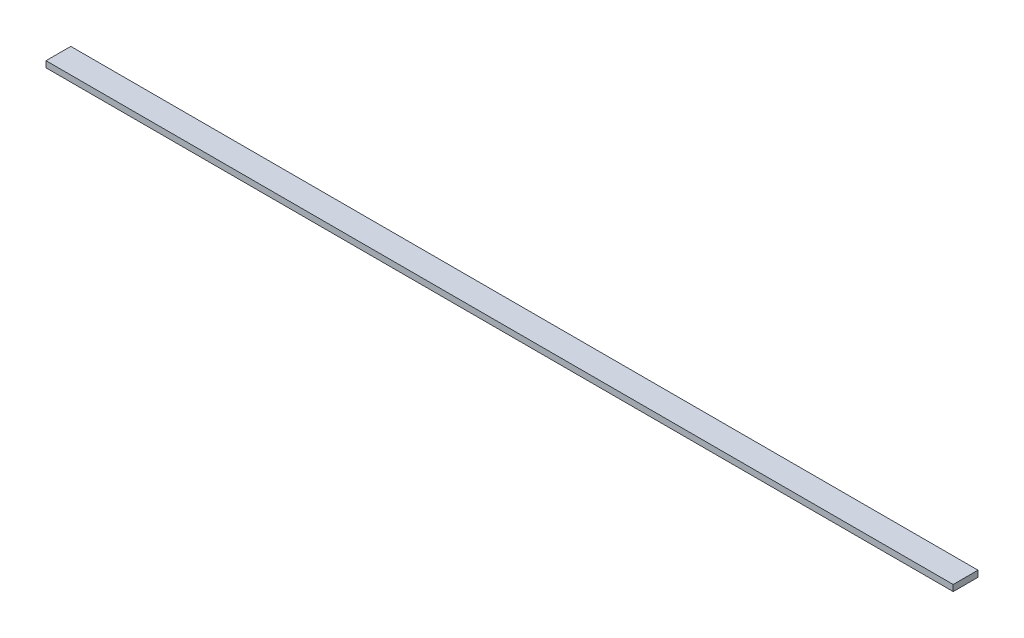
ISO-10303-21;
HEADER;
FILE_DESCRIPTION(('STEP AP214'),'2;1');
FILE_NAME('part.step','',(''),(''),'','','');
FILE_SCHEMA(('AUTOMOTIVE_DESIGN { 1 0 10303 214 1 1 1 1 }'));
ENDSEC;
DATA;
#1=APPLICATION_CONTEXT('core data for automotive mechanical design processes');
#2=APPLICATION_PROTOCOL_DEFINITION('international standard','automotive_design',2000,#1);
#3=PRODUCT_CONTEXT('',#1,'mechanical');
#4=PRODUCT('Part','Part','',(#3));
#5=PRODUCT_RELATED_PRODUCT_CATEGORY('part','',(#4));
#6=PRODUCT_DEFINITION_FORMATION('','',#4);
#7=PRODUCT_DEFINITION_CONTEXT('part definition',#1,'design');
#8=PRODUCT_DEFINITION('design','',#6,#7);
#9=PRODUCT_DEFINITION_SHAPE('','',#8);
#10=(LENGTH_UNIT() NAMED_UNIT(*) SI_UNIT(.MILLI.,.METRE.));
#11=(NAMED_UNIT(*) PLANE_ANGLE_UNIT() SI_UNIT($,.RADIAN.));
#12=(NAMED_UNIT(*) SI_UNIT($,.STERADIAN.) SOLID_ANGLE_UNIT());
#13=UNCERTAINTY_MEASURE_WITH_UNIT(LENGTH_MEASURE(1.E-05),#10,'distance_accuracy_value','');
#14=(GEOMETRIC_REPRESENTATION_CONTEXT(3) GLOBAL_UNCERTAINTY_ASSIGNED_CONTEXT((#13)) GLOBAL_UNIT_ASSIGNED_CONTEXT((#10,
#11,#12)) REPRESENTATION_CONTEXT('',''));
#15=CARTESIAN_POINT('',(0.,0.,0.));
#16=DIRECTION('',(0.,0.,1.));
#17=DIRECTION('',(1.,0.,0.));
#18=AXIS2_PLACEMENT_3D('',#15,#16,#17);
#19=CARTESIAN_POINT('',(-116.205,1.5875,3.17500000000001));
#20=DIRECTION('',(1.,0.,0.));
#21=DIRECTION('',(0.,0.,-1.));
#22=AXIS2_PLACEMENT_3D('',#19,#20,#21);
#23=PLANE('',#22);
#24=DIRECTION('',(0.,0.,1.));
#25=VECTOR('',#24,1.);
#26=CARTESIAN_POINT('',(-116.205,0.,3.17500000000001));
#27=LINE('',#26,#25);
#28=CARTESIAN_POINT('',(-116.205,0.,-3.17499999999999));
#29=VERTEX_POINT('',#28);
#30=CARTESIAN_POINT('',(-116.205,0.,3.17500000000001));
#31=VERTEX_POINT('',#30);
#32=EDGE_CURVE('E96',#29,#31,#27,.T.);
#33=ORIENTED_EDGE('',*,*,#32,.T.);
#34=DIRECTION('',(0.,-1.,0.));
#35=VECTOR('',#34,1.);
#36=CARTESIAN_POINT('',(-116.205,1.5875,3.17500000000001));
#37=LINE('',#36,#35);
#38=CARTESIAN_POINT('',(-116.205,1.5875,3.17500000000001));
#39=VERTEX_POINT('',#38);
#40=EDGE_CURVE('E11',#39,#31,#37,.T.);
#41=ORIENTED_EDGE('',*,*,#40,.F.);
#42=DIRECTION('',(0.,0.,1.));
#43=VECTOR('',#42,1.);
#44=CARTESIAN_POINT('',(-116.205,1.5875,3.17500000000001));
#45=LINE('',#44,#43);
#46=CARTESIAN_POINT('',(-116.205,1.5875,-3.17499999999999));
#47=VERTEX_POINT('',#46);
#48=EDGE_CURVE('E84',#47,#39,#45,.T.);
#49=ORIENTED_EDGE('',*,*,#48,.F.);
#50=DIRECTION('',(0.,-1.,0.));
#51=VECTOR('',#50,1.);
#52=CARTESIAN_POINT('',(-116.205,1.5875,-3.17499999999999));
#53=LINE('',#52,#51);
#54=EDGE_CURVE('E92',#47,#29,#53,.T.);
#55=ORIENTED_EDGE('',*,*,#54,.T.);
#56=EDGE_LOOP('',(#33,#41,#49,#55));
#57=FACE_BOUND('',#56,.T.);
#58=ADVANCED_FACE('F33',(#57),#23,.F.);
#59=CARTESIAN_POINT('',(116.205,1.5875,3.17499999999998));
#60=DIRECTION('',(0.,0.,-1.));
#61=DIRECTION('',(-1.,0.,0.));
#62=AXIS2_PLACEMENT_3D('',#59,#60,#61);
#63=PLANE('',#62);
#64=DIRECTION('',(1.,0.,0.));
#65=VECTOR('',#64,1.);
#66=CARTESIAN_POINT('',(116.205,0.,3.17499999999998));
#67=LINE('',#66,#65);
#68=CARTESIAN_POINT('',(116.205,0.,3.17499999999998));
#69=VERTEX_POINT('',#68);
#70=EDGE_CURVE('E88',#31,#69,#67,.T.);
#71=ORIENTED_EDGE('',*,*,#70,.T.);
#72=DIRECTION('',(0.,-1.,0.));
#73=VECTOR('',#72,1.);
#74=CARTESIAN_POINT('',(116.205,1.5875,3.17499999999998));
#75=LINE('',#74,#73);
#76=CARTESIAN_POINT('',(116.205,1.5875,3.17499999999998));
#77=VERTEX_POINT('',#76);
#78=EDGE_CURVE('E41',#77,#69,#75,.T.);
#79=ORIENTED_EDGE('',*,*,#78,.F.);
#80=DIRECTION('',(1.,0.,0.));
#81=VECTOR('',#80,1.);
#82=CARTESIAN_POINT('',(116.205,1.5875,3.17499999999998));
#83=LINE('',#82,#81);
#84=EDGE_CURVE('E79',#39,#77,#83,.T.);
#85=ORIENTED_EDGE('',*,*,#84,.F.);
#86=ORIENTED_EDGE('',*,*,#40,.T.);
#87=EDGE_LOOP('',(#71,#79,#85,#86));
#88=FACE_BOUND('',#87,.T.);
#89=ADVANCED_FACE('F87',(#88),#63,.F.);
#90=CARTESIAN_POINT('',(116.205,1.5875,3.17499999999998));
#91=DIRECTION('',(-1.,0.,0.));
#92=DIRECTION('',(0.,0.,1.));
#93=AXIS2_PLACEMENT_3D('',#90,#91,#92);
#94=PLANE('',#93);
#95=DIRECTION('',(0.,0.,-1.));
#96=VECTOR('',#95,1.);
#97=CARTESIAN_POINT('',(116.205,0.,3.17499999999998));
#98=LINE('',#97,#96);
#99=CARTESIAN_POINT('',(116.205,0.,-3.17500000000001));
#100=VERTEX_POINT('',#99);
#101=EDGE_CURVE('E66',#69,#100,#98,.T.);
#102=ORIENTED_EDGE('',*,*,#101,.T.);
#103=DIRECTION('',(0.,-1.,0.));
#104=VECTOR('',#103,1.);
#105=CARTESIAN_POINT('',(116.205,1.5875,-3.17500000000001));
#106=LINE('',#105,#104);
#107=CARTESIAN_POINT('',(116.205,1.5875,-3.17500000000001));
#108=VERTEX_POINT('',#107);
#109=EDGE_CURVE('E89',#108,#100,#106,.T.);
#110=ORIENTED_EDGE('',*,*,#109,.F.);
#111=DIRECTION('',(0.,0.,-1.));
#112=VECTOR('',#111,1.);
#113=CARTESIAN_POINT('',(116.205,1.5875,3.17499999999998));
#114=LINE('',#113,#112);
#115=EDGE_CURVE('E82',#77,#108,#114,.T.);
#116=ORIENTED_EDGE('',*,*,#115,.F.);
#117=ORIENTED_EDGE('',*,*,#78,.T.);
#118=EDGE_LOOP('',(#102,#110,#116,#117));
#119=FACE_BOUND('',#118,.T.);
#120=ADVANCED_FACE('F90',(#119),#94,.F.);
#121=CARTESIAN_POINT('',(116.205,1.5875,-3.17500000000001));
#122=DIRECTION('',(0.,0.,1.));
#123=DIRECTION('',(1.,0.,0.));
#124=AXIS2_PLACEMENT_3D('',#121,#122,#123);
#125=PLANE('',#124);
#126=DIRECTION('',(-1.,0.,0.));
#127=VECTOR('',#126,1.);
#128=CARTESIAN_POINT('',(116.205,0.,-3.17500000000001));
#129=LINE('',#128,#127);
#130=EDGE_CURVE('E72',#100,#29,#129,.T.);
#131=ORIENTED_EDGE('',*,*,#130,.T.);
#132=ORIENTED_EDGE('',*,*,#54,.F.);
#133=DIRECTION('',(-1.,0.,0.));
#134=VECTOR('',#133,1.);
#135=CARTESIAN_POINT('',(116.205,1.5875,-3.17500000000001));
#136=LINE('',#135,#134);
#137=EDGE_CURVE('E49',#108,#47,#136,.T.);
#138=ORIENTED_EDGE('',*,*,#137,.F.);
#139=ORIENTED_EDGE('',*,*,#109,.T.);
#140=EDGE_LOOP('',(#131,#132,#138,#139));
#141=FACE_BOUND('',#140,.T.);
#142=ADVANCED_FACE('F103',(#141),#125,.F.);
#143=CARTESIAN_POINT('',(0.,1.5875,0.));
#144=DIRECTION('',(0.,1.,0.));
#145=DIRECTION('',(0.,0.,1.));
#146=AXIS2_PLACEMENT_3D('',#143,#144,#145);
#147=PLANE('',#146);
#148=ORIENTED_EDGE('',*,*,#48,.T.);
#149=ORIENTED_EDGE('',*,*,#84,.T.);
#150=ORIENTED_EDGE('',*,*,#115,.T.);
#151=ORIENTED_EDGE('',*,*,#137,.T.);
#152=EDGE_LOOP('',(#148,#149,#150,#151));
#153=FACE_BOUND('',#152,.T.);
#154=ADVANCED_FACE('F80',(#153),#147,.T.);
#155=CARTESIAN_POINT('',(0.,0.,0.));
#156=DIRECTION('',(0.,1.,0.));
#157=DIRECTION('',(0.,0.,1.));
#158=AXIS2_PLACEMENT_3D('',#155,#156,#157);
#159=PLANE('',#158);
#160=ORIENTED_EDGE('',*,*,#32,.F.);
#161=ORIENTED_EDGE('',*,*,#130,.F.);
#162=ORIENTED_EDGE('',*,*,#101,.F.);
#163=ORIENTED_EDGE('',*,*,#70,.F.);
#164=EDGE_LOOP('',(#160,#161,#162,#163));
#165=FACE_BOUND('',#164,.T.);
#166=ADVANCED_FACE('F106',(#165),#159,.F.);
#167=CLOSED_SHELL('',(#58,#89,#120,#142,#154,#166));
#168=MANIFOLD_SOLID_BREP('B2',#167);
#169=ADVANCED_BREP_SHAPE_REPRESENTATION('',(#18,#168),#14);
#170=SHAPE_DEFINITION_REPRESENTATION(#9,#169);
ENDSEC;
END-ISO-10303-21;
